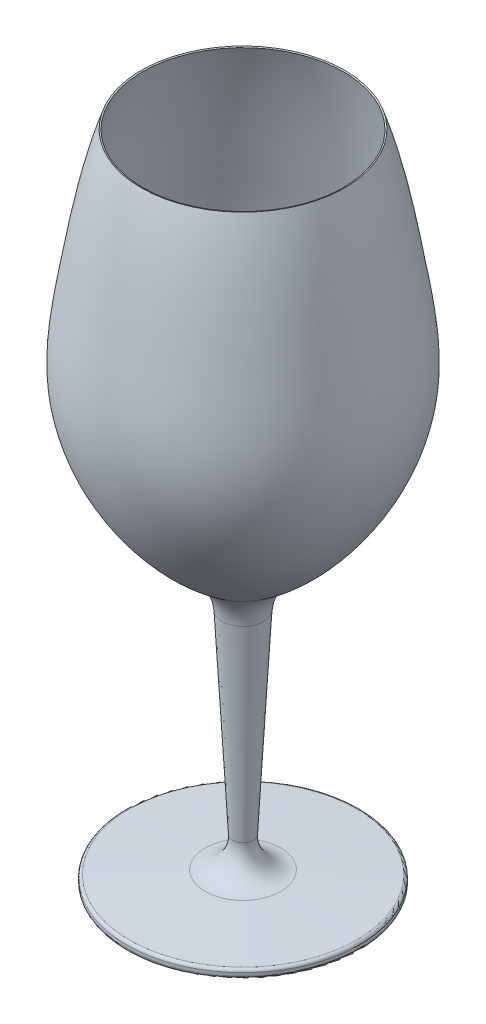
ISO-10303-21;
HEADER;
FILE_DESCRIPTION(('STEP AP214'),'2;1');
FILE_NAME('part.step','',(''),(''),'','','');
FILE_SCHEMA(('AUTOMOTIVE_DESIGN { 1 0 10303 214 1 1 1 1 }'));
ENDSEC;
DATA;
#1=APPLICATION_CONTEXT('core data for automotive mechanical design processes');
#2=APPLICATION_PROTOCOL_DEFINITION('international standard','automotive_design',2000,#1);
#3=PRODUCT_CONTEXT('',#1,'mechanical');
#4=PRODUCT('Part','Part','',(#3));
#5=PRODUCT_RELATED_PRODUCT_CATEGORY('part','',(#4));
#6=PRODUCT_DEFINITION_FORMATION('','',#4);
#7=PRODUCT_DEFINITION_CONTEXT('part definition',#1,'design');
#8=PRODUCT_DEFINITION('design','',#6,#7);
#9=PRODUCT_DEFINITION_SHAPE('','',#8);
#10=(LENGTH_UNIT() NAMED_UNIT(*) SI_UNIT(.MILLI.,.METRE.));
#11=(NAMED_UNIT(*) PLANE_ANGLE_UNIT() SI_UNIT($,.RADIAN.));
#12=(NAMED_UNIT(*) SI_UNIT($,.STERADIAN.) SOLID_ANGLE_UNIT());
#13=UNCERTAINTY_MEASURE_WITH_UNIT(LENGTH_MEASURE(1.E-05),#10,'distance_accuracy_value','');
#14=(GEOMETRIC_REPRESENTATION_CONTEXT(3) GLOBAL_UNCERTAINTY_ASSIGNED_CONTEXT((#13)) GLOBAL_UNIT_ASSIGNED_CONTEXT((#10,
#11,#12)) REPRESENTATION_CONTEXT('',''));
#15=CARTESIAN_POINT('',(0.,0.,0.));
#16=DIRECTION('',(0.,0.,1.));
#17=DIRECTION('',(1.,0.,0.));
#18=AXIS2_PLACEMENT_3D('',#15,#16,#17);
#19=CARTESIAN_POINT('',(7.5,90.5,0.));
#20=DIRECTION('',(0.,-1.,0.));
#21=DIRECTION('',(0.,0.,-1.));
#22=AXIS2_PLACEMENT_3D('',#19,#20,#21);
#23=PLANE('',#22);
#24=CARTESIAN_POINT('',(0.,90.5,0.));
#25=DIRECTION('',(0.,1.,0.));
#26=DIRECTION('',(0.,0.,1.));
#27=AXIS2_PLACEMENT_3D('',#24,#25,#26);
#28=CIRCLE('',#27,7.36580755563535);
#29=CARTESIAN_POINT('',(0.,90.5,7.36580755563535));
#30=VERTEX_POINT('',#29);
#31=EDGE_CURVE('E85',#30,#30,#28,.T.);
#32=ORIENTED_EDGE('',*,*,#31,.T.);
#33=EDGE_LOOP('',(#32));
#34=FACE_BOUND('',#33,.T.);
#35=ADVANCED_FACE('F37',(#34),#23,.F.);
#36=CARTESIAN_POINT('',(35.,225.,0.));
#37=CARTESIAN_POINT('',(39.9170201792757,210.365056176156,0.));
#38=CARTESIAN_POINT('',(44.1056743266489,185.466353245277,0.));
#39=CARTESIAN_POINT('',(52.4361400505516,135.138835851977,0.));
#40=CARTESIAN_POINT('',(28.2814009491732,101.995192324676,0.));
#41=CARTESIAN_POINT('',(7.49999999999999,90.,0.));
#42=B_SPLINE_CURVE_WITH_KNOTS('',3,(#36,#37,#38,#39,#40,#41),.UNSPECIFIED.,.F.,.F.,(4,1,1,4),
(0.,0.30696974385016,0.507280242844437,1.),.UNSPECIFIED.);
#43=CARTESIAN_POINT('',(0.,231.75,0.));
#44=DIRECTION('',(0.,1.,0.));
#45=AXIS1_PLACEMENT('',#43,#44);
#46=SURFACE_OF_REVOLUTION('',#42,#45);
#47=CARTESIAN_POINT('',(0.,94.0246612386085,0.));
#48=DIRECTION('',(0.,1.,0.));
#49=DIRECTION('',(0.,0.,1.));
#50=AXIS2_PLACEMENT_3D('',#47,#48,#49);
#51=CIRCLE('',#50,13.7404106026119);
#52=CARTESIAN_POINT('',(0.,94.0246612386085,13.7404106026119));
#53=VERTEX_POINT('',#52);
#54=EDGE_CURVE('E65',#53,#53,#51,.T.);
#55=ORIENTED_EDGE('',*,*,#54,.T.);
#56=EDGE_LOOP('',(#55));
#57=FACE_BOUND('',#56,.T.);
#58=CARTESIAN_POINT('',(0.,225.,0.));
#59=DIRECTION('',(0.,1.,0.));
#60=DIRECTION('',(0.,0.,1.));
#61=AXIS2_PLACEMENT_3D('',#58,#59,#60);
#62=CIRCLE('',#61,35.);
#63=CARTESIAN_POINT('',(0.,225.,35.));
#64=VERTEX_POINT('',#63);
#65=EDGE_CURVE('E77',#64,#64,#62,.T.);
#66=ORIENTED_EDGE('',*,*,#65,.F.);
#67=EDGE_LOOP('',(#66));
#68=FACE_BOUND('',#67,.T.);
#69=ADVANCED_FACE('F110',(#57,#68),#46,.F.);
#70=CARTESIAN_POINT('',(0.,224.840758404647,0.));
#71=DIRECTION('',(0.,1.,0.));
#72=DIRECTION('',(0.,0.,1.));
#73=AXIS2_PLACEMENT_3D('',#70,#71,#72);
#74=CONICAL_SURFACE('',#73,34.5260357457473,1.24666740101103);
#75=ORIENTED_EDGE('',*,*,#65,.T.);
#76=EDGE_LOOP('',(#75));
#77=FACE_BOUND('',#76,.T.);
#78=CARTESIAN_POINT('',(0.,224.840758404647,0.));
#79=DIRECTION('',(0.,1.,0.));
#80=DIRECTION('',(0.,0.,1.));
#81=AXIS2_PLACEMENT_3D('',#78,#79,#80);
#82=CIRCLE('',#81,34.5260357457473);
#83=CARTESIAN_POINT('',(0.,224.840758404647,34.5260357457473));
#84=VERTEX_POINT('',#83);
#85=EDGE_CURVE('E81',#84,#84,#82,.T.);
#86=ORIENTED_EDGE('',*,*,#85,.F.);
#87=EDGE_LOOP('',(#86));
#88=FACE_BOUND('',#87,.T.);
#89=ADVANCED_FACE('F105',(#77,#88),#74,.F.);
#90=CARTESIAN_POINT('',(34.5260357457473,224.840758404647,0.));
#91=CARTESIAN_POINT('',(38.5134237229265,212.972757680174,0.));
#92=CARTESIAN_POINT('',(40.9330721074188,200.804932363677,0.));
#93=CARTESIAN_POINT('',(43.6025770812448,185.350494263988,0.));
#94=CARTESIAN_POINT('',(44.1195015259819,182.246673106994,0.));
#95=CARTESIAN_POINT('',(45.1551011310871,176.021305771008,0.));
#96=CARTESIAN_POINT('',(45.6664132655204,172.903480540182,0.));
#97=CARTESIAN_POINT('',(46.9540801874857,163.5571058913,0.));
#98=CARTESIAN_POINT('',(47.483447686818,157.336251857612,0.));
#99=CARTESIAN_POINT('',(46.887857201014,148.109063780249,0.));
#100=CARTESIAN_POINT('',(46.4484540362197,145.046089868041,0.));
#101=CARTESIAN_POINT('',(45.1248415608101,138.980779569992,0.));
#102=CARTESIAN_POINT('',(44.2420199226576,135.979713915717,0.));
#103=CARTESIAN_POINT('',(40.9995332141692,127.1369328505,0.));
#104=CARTESIAN_POINT('',(38.0456792538947,121.455648509251,0.));
#105=CARTESIAN_POINT('',(27.3662952808406,105.581699817172,0.));
#106=CARTESIAN_POINT('',(17.8215249659856,96.5608248764769,0.));
#107=CARTESIAN_POINT('',(7.36580755563538,90.5,0.));
#108=B_SPLINE_CURVE_WITH_KNOTS('',3,(#90,#91,#92,#93,#94,#95,#96,#97,#98,#99,#100,#101,#102,
#103,#104,#105,#106,#107),.UNSPECIFIED.,.F.,.F.,(4,2,2,2,2,2,2,2,4),(0.,0.25,0.3125,
0.374999999999999,0.5,0.5625,0.625,0.75,1.),.UNSPECIFIED.);
#109=CARTESIAN_POINT('',(0.,231.75,0.));
#110=DIRECTION('',(0.,1.,0.));
#111=AXIS1_PLACEMENT('',#109,#110);
#112=SURFACE_OF_REVOLUTION('',#108,#111);
#113=ORIENTED_EDGE('',*,*,#31,.F.);
#114=EDGE_LOOP('',(#113));
#115=FACE_BOUND('',#114,.T.);
#116=ORIENTED_EDGE('',*,*,#85,.T.);
#117=EDGE_LOOP('',(#116));
#118=FACE_BOUND('',#117,.T.);
#119=ADVANCED_FACE('F100',(#115,#118),#112,.T.);
#120=CARTESIAN_POINT('',(0.,0.,0.));
#121=DIRECTION('',(0.,1.,0.));
#122=DIRECTION('',(0.,0.,1.));
#123=AXIS2_PLACEMENT_3D('',#120,#121,#122);
#124=PLANE('',#123);
#125=CARTESIAN_POINT('',(0.,0.,0.));
#126=DIRECTION('',(0.,1.,0.));
#127=DIRECTION('',(0.,0.,1.));
#128=AXIS2_PLACEMENT_3D('',#125,#126,#127);
#129=CIRCLE('',#128,39.);
#130=CARTESIAN_POINT('',(0.,0.,39.));
#131=VERTEX_POINT('',#130);
#132=EDGE_CURVE('E45',#131,#131,#129,.F.);
#133=ORIENTED_EDGE('',*,*,#132,.T.);
#134=EDGE_LOOP('',(#133));
#135=FACE_BOUND('',#134,.T.);
#136=ADVANCED_FACE('F104',(#135),#124,.F.);
#137=CARTESIAN_POINT('',(0.,231.75,0.));
#138=DIRECTION('',(0.,1.,0.));
#139=DIRECTION('',(0.,0.,1.));
#140=AXIS2_PLACEMENT_3D('',#137,#138,#139);
#141=CYLINDRICAL_SURFACE('',#140,40.);
#142=CARTESIAN_POINT('',(0.,1.,0.));
#143=DIRECTION('',(0.,1.,0.));
#144=DIRECTION('',(0.,0.,1.));
#145=AXIS2_PLACEMENT_3D('',#142,#143,#144);
#146=CIRCLE('',#145,40.);
#147=CARTESIAN_POINT('',(0.,1.,40.));
#148=VERTEX_POINT('',#147);
#149=EDGE_CURVE('E50',#148,#148,#146,.T.);
#150=ORIENTED_EDGE('',*,*,#149,.T.);
#151=EDGE_LOOP('',(#150));
#152=FACE_BOUND('',#151,.T.);
#153=CARTESIAN_POINT('',(0.,2.05259419926224,0.));
#154=DIRECTION('',(0.,-1.,0.));
#155=DIRECTION('',(0.,0.,-1.));
#156=AXIS2_PLACEMENT_3D('',#153,#154,#155);
#157=CIRCLE('',#156,40.);
#158=CARTESIAN_POINT('',(0.,2.05259419926224,-40.));
#159=VERTEX_POINT('',#158);
#160=EDGE_CURVE('E55',#159,#159,#157,.T.);
#161=ORIENTED_EDGE('',*,*,#160,.T.);
#162=EDGE_LOOP('',(#161));
#163=FACE_BOUND('',#162,.T.);
#164=ADVANCED_FACE('F136',(#152,#163),#141,.T.);
#165=CARTESIAN_POINT('',(0.,3.,0.));
#166=DIRECTION('',(0.,-1.,0.));
#167=DIRECTION('',(0.,0.,-1.));
#168=AXIS2_PLACEMENT_3D('',#165,#166,#167);
#169=CONICAL_SURFACE('',#168,40.,1.51679482641893);
#170=CARTESIAN_POINT('',(0.,3.05113647253973,0.));
#171=DIRECTION('',(0.,1.,0.));
#172=DIRECTION('',(0.,0.,1.));
#173=AXIS2_PLACEMENT_3D('',#170,#171,#172);
#174=CIRCLE('',#173,39.053975258015);
#175=CARTESIAN_POINT('',(0.,3.05113647253973,-39.053975258015));
#176=VERTEX_POINT('',#175);
#177=EDGE_CURVE('E10',#176,#176,#174,.T.);
#178=CARTESIAN_POINT('',(0.,4.46084605201327,0.));
#179=DIRECTION('',(0.,-1.,0.));
#180=DIRECTION('',(0.,0.,-1.));
#181=AXIS2_PLACEMENT_3D('',#178,#179,#180);
#182=CIRCLE('',#181,12.9743480377545);
#183=CARTESIAN_POINT('',(0.,4.46084605201327,-12.9743480377545));
#184=VERTEX_POINT('',#183);
#185=EDGE_CURVE('E69',#184,#184,#182,.T.);
#186=CARTESIAN_POINT('',(0.,3.05113647253973,-39.053975258015));
#187=CARTESIAN_POINT('',(0.,3.06582094732591,-38.7823124744706));
#188=CARTESIAN_POINT('',(0.,3.0805054221121,-38.5106496909263));
#189=CARTESIAN_POINT('',(0.,3.10987437168446,-37.9673241238375));
#190=CARTESIAN_POINT('',(0.,3.12455884647065,-37.6956613402931));
#191=CARTESIAN_POINT('',(0.,3.15392779604301,-37.1523357732043));
#192=CARTESIAN_POINT('',(0.,3.16861227082919,-36.88067298966));
#193=CARTESIAN_POINT('',(0.,3.19798122040156,-36.3373474225712));
#194=CARTESIAN_POINT('',(0.,3.21266569518774,-36.0656846390268));
#195=CARTESIAN_POINT('',(0.,3.24203464476011,-35.5223590719381));
#196=CARTESIAN_POINT('',(0.,3.25671911954629,-35.2506962883937));
#197=CARTESIAN_POINT('',(0.,3.28608806911866,-34.7073707213049));
#198=CARTESIAN_POINT('',(0.,3.30077254390484,-34.4357079377605));
#199=CARTESIAN_POINT('',(0.,3.3301414934772,-33.8923823706718));
#200=CARTESIAN_POINT('',(0.,3.34482596826339,-33.6207195871274));
#201=CARTESIAN_POINT('',(0.,3.37419491783575,-33.0773940200386));
#202=CARTESIAN_POINT('',(0.,3.38887939262193,-32.8057312364943));
#203=CARTESIAN_POINT('',(0.,3.4182483421943,-32.2624056694055));
#204=CARTESIAN_POINT('',(0.,3.43293281698048,-31.9907428858611));
#205=CARTESIAN_POINT('',(0.,3.46230176655285,-31.4474173187724));
#206=CARTESIAN_POINT('',(0.,3.47698624133903,-31.175754535228));
#207=CARTESIAN_POINT('',(0.,3.5063551909114,-30.6324289681392));
#208=CARTESIAN_POINT('',(0.,3.52103966569758,-30.3607661845948));
#209=CARTESIAN_POINT('',(0.,3.55040861526994,-29.8174406175061));
#210=CARTESIAN_POINT('',(0.,3.56509309005613,-29.5457778339617));
#211=CARTESIAN_POINT('',(0.,3.59446203962849,-29.0024522668729));
#212=CARTESIAN_POINT('',(0.,3.60914651441468,-28.7307894833285));
#213=CARTESIAN_POINT('',(0.,3.63851546398704,-28.1874639162398));
#214=CARTESIAN_POINT('',(0.,3.65319993877322,-27.9158011326954));
#215=CARTESIAN_POINT('',(0.,3.68256888834559,-27.3724755656066));
#216=CARTESIAN_POINT('',(0.,3.69725336313177,-27.1008127820623));
#217=CARTESIAN_POINT('',(0.,3.72662231270414,-26.5574872149735));
#218=CARTESIAN_POINT('',(0.,3.74130678749032,-26.2858244314291));
#219=CARTESIAN_POINT('',(0.,3.77067573706269,-25.7424988643404));
#220=CARTESIAN_POINT('',(0.,3.78536021184887,-25.470836080796));
#221=CARTESIAN_POINT('',(0.,3.81472916142123,-24.9275105137072));
#222=CARTESIAN_POINT('',(0.,3.82941363620742,-24.6558477301628));
#223=CARTESIAN_POINT('',(0.,3.85878258577978,-24.1125221630741));
#224=CARTESIAN_POINT('',(0.,3.87346706056596,-23.8408593795297));
#225=CARTESIAN_POINT('',(0.,3.90283601013833,-23.2975338124409));
#226=CARTESIAN_POINT('',(0.,3.91752048492451,-23.0258710288966));
#227=CARTESIAN_POINT('',(0.,3.94688943449688,-22.4825454618078));
#228=CARTESIAN_POINT('',(0.,3.96157390928306,-22.2108826782634));
#229=CARTESIAN_POINT('',(0.,3.99094285885543,-21.6675571111746));
#230=CARTESIAN_POINT('',(0.,4.00562733364161,-21.3958943276303));
#231=CARTESIAN_POINT('',(0.,4.03499628321397,-20.8525687605415));
#232=CARTESIAN_POINT('',(0.,4.04968075800016,-20.5809059769971));
#233=CARTESIAN_POINT('',(0.,4.07904970757252,-20.0375804099084));
#234=CARTESIAN_POINT('',(0.,4.09373418235871,-19.765917626364));
#235=CARTESIAN_POINT('',(0.,4.12310313193107,-19.2225920592752));
#236=CARTESIAN_POINT('',(0.,4.13778760671725,-18.9509292757308));
#237=CARTESIAN_POINT('',(0.,4.16715655628962,-18.4076037086421));
#238=CARTESIAN_POINT('',(0.,4.1818410310758,-18.1359409250977));
#239=CARTESIAN_POINT('',(0.,4.21120998064817,-17.5926153580089));
#240=CARTESIAN_POINT('',(0.,4.22589445543435,-17.3209525744646));
#241=CARTESIAN_POINT('',(0.,4.25526340500672,-16.7776270073758));
#242=CARTESIAN_POINT('',(0.,4.2699478797929,-16.5059642238314));
#243=CARTESIAN_POINT('',(0.,4.29931682936526,-15.9626386567427));
#244=CARTESIAN_POINT('',(0.,4.31400130415145,-15.6909758731983));
#245=CARTESIAN_POINT('',(0.,4.34337025372381,-15.1476503061095));
#246=CARTESIAN_POINT('',(0.,4.35805472850999,-14.8759875225651));
#247=CARTESIAN_POINT('',(0.,4.38742367808236,-14.3326619554764));
#248=CARTESIAN_POINT('',(0.,4.40210815286854,-14.060999171932));
#249=CARTESIAN_POINT('',(0.,4.43147710244091,-13.5176736048432));
#250=CARTESIAN_POINT('',(0.,4.44616157722709,-13.2460108212988));
#251=CARTESIAN_POINT('',(0.,4.46084605201327,-12.9743480377545));
#252=B_SPLINE_CURVE_WITH_KNOTS('',3,(#186,#187,#188,#189,#190,#191,#192,#193,#194,#195,#196,
#197,#198,#199,#200,#201,#202,#203,#204,#205,#206,#207,#208,#209,#210,#211,#212,#213,#214,#215,
#216,#217,#218,#219,#220,#221,#222,#223,#224,#225,#226,#227,#228,#229,#230,#231,#232,#233,#234,
#235,#236,#237,#238,#239,#240,#241,#242,#243,#244,#245,#246,#247,#248,#249,#250,#251),
.UNSPECIFIED.,.F.,.F.,(4,2,2,2,2,2,2,2,2,2,2,2,2,2,2,2,2,2,2,2,2,2,2,2,2,2,2,2,2,2,2,2,4),(0.,
0.816178115282103,1.63235623056421,2.4485343458463,3.2647124611284,4.08089057641051,
4.89706869169261,5.71324680697471,6.52942492225681,7.34560303753891,8.16178115282101,
8.97795926810311,9.79413738338522,10.6103154986673,11.4264936139494,12.2426717292315,
13.0588498445136,13.8750279597957,14.6912060750778,15.5073841903599,16.323562305642,
17.1397404209241,17.9559185362062,18.7720966514883,19.5882747667704,20.4044528820525,
21.2206309973346,22.0368091126167,22.8529872278989,23.669165343181,24.4853434584631,
25.3015215737452,26.1176996890273),.UNSPECIFIED.);
#253=EDGE_CURVE('BSEAM139',#176,#184,#252,.T.);
#254=ORIENTED_EDGE('',*,*,#177,.T.);
#255=ORIENTED_EDGE('',*,*,#185,.T.);
#256=ORIENTED_EDGE('',*,*,#253,.T.);
#257=ORIENTED_EDGE('',*,*,#253,.F.);
#258=EDGE_LOOP('',(#254,#256,#255,#257));
#259=FACE_BOUND('',#258,.T.);
#260=ADVANCED_FACE('F139',(#259),#169,.T.);
#261=CARTESIAN_POINT('',(0.,5.,0.));
#262=DIRECTION('',(0.,1.,0.));
#263=DIRECTION('',(0.,0.,1.));
#264=AXIS2_PLACEMENT_3D('',#261,#262,#263);
#265=CONICAL_SURFACE('',#264,3.00000000000001,0.0528917988657199);
#266=CARTESIAN_POINT('',(0.,81.8552378264217,0.));
#267=DIRECTION('',(0.,-1.,0.));
#268=DIRECTION('',(0.,0.,-1.));
#269=AXIS2_PLACEMENT_3D('',#266,#267,#268);
#270=CIRCLE('',#269,7.06880670845761);
#271=CARTESIAN_POINT('',(0.,81.8552378264217,-7.06880670845761));
#272=VERTEX_POINT('',#271);
#273=EDGE_CURVE('E61',#272,#272,#270,.T.);
#274=ORIENTED_EDGE('',*,*,#273,.T.);
#275=EDGE_LOOP('',(#274));
#276=FACE_BOUND('',#275,.T.);
#277=CARTESIAN_POINT('',(0.,14.9749401961898,0.));
#278=DIRECTION('',(0.,1.,0.));
#279=DIRECTION('',(0.,0.,1.));
#280=AXIS2_PLACEMENT_3D('',#277,#278,#279);
#281=CIRCLE('',#280,3.52808506921006);
#282=CARTESIAN_POINT('',(0.,14.9749401961898,3.52808506921006));
#283=VERTEX_POINT('',#282);
#284=EDGE_CURVE('E73',#283,#283,#281,.T.);
#285=ORIENTED_EDGE('',*,*,#284,.T.);
#286=EDGE_LOOP('',(#285));
#287=FACE_BOUND('',#286,.T.);
#288=ADVANCED_FACE('F122',(#276,#287),#265,.T.);
#289=CARTESIAN_POINT('',(0.,14.4462687847884,0.));
#290=DIRECTION('',(0.,1.,0.));
#291=DIRECTION('',(0.,0.,1.));
#292=AXIS2_PLACEMENT_3D('',#289,#290,#291);
#293=TOROIDAL_SURFACE('',#292,13.5141006179045,10.);
#294=ORIENTED_EDGE('',*,*,#185,.F.);
#295=EDGE_LOOP('',(#294));
#296=FACE_BOUND('',#295,.T.);
#297=ORIENTED_EDGE('',*,*,#284,.F.);
#298=EDGE_LOOP('',(#297));
#299=FACE_BOUND('',#298,.T.);
#300=ADVANCED_FACE('F118',(#296,#299),#293,.F.);
#301=CARTESIAN_POINT('',(0.,81.0093635681793,0.));
#302=DIRECTION('',(0.,1.,0.));
#303=DIRECTION('',(0.,0.,1.));
#304=AXIS2_PLACEMENT_3D('',#301,#302,#303);
#305=TOROIDAL_SURFACE('',#304,23.0464315863687,16.);
#306=ORIENTED_EDGE('',*,*,#273,.F.);
#307=EDGE_LOOP('',(#306));
#308=FACE_BOUND('',#307,.T.);
#309=ORIENTED_EDGE('',*,*,#54,.F.);
#310=EDGE_LOOP('',(#309));
#311=FACE_BOUND('',#310,.T.);
#312=ADVANCED_FACE('F121',(#308,#311),#305,.F.);
#313=CARTESIAN_POINT('',(0.,1.,0.));
#314=DIRECTION('',(0.,1.,0.));
#315=DIRECTION('',(0.,0.,1.));
#316=AXIS2_PLACEMENT_3D('',#313,#314,#315);
#317=TOROIDAL_SURFACE('',#316,39.,1.);
#318=ORIENTED_EDGE('',*,*,#132,.F.);
#319=EDGE_LOOP('',(#318));
#320=FACE_BOUND('',#319,.T.);
#321=ORIENTED_EDGE('',*,*,#149,.F.);
#322=EDGE_LOOP('',(#321));
#323=FACE_BOUND('',#322,.T.);
#324=ADVANCED_FACE('F125',(#320,#323),#317,.T.);
#325=CARTESIAN_POINT('',(0.,2.05259419926224,0.));
#326=DIRECTION('',(0.,-1.,0.));
#327=DIRECTION('',(0.,0.,-1.));
#328=AXIS2_PLACEMENT_3D('',#325,#326,#327);
#329=TOROIDAL_SURFACE('',#328,39.,1.);
#330=ORIENTED_EDGE('',*,*,#160,.F.);
#331=EDGE_LOOP('',(#330));
#332=FACE_BOUND('',#331,.T.);
#333=ORIENTED_EDGE('',*,*,#177,.F.);
#334=EDGE_LOOP('',(#333));
#335=FACE_BOUND('',#334,.T.);
#336=ADVANCED_FACE('F39',(#332,#335),#329,.T.);
#337=CLOSED_SHELL('',(#35,#69,#89,#119,#136,#164,#260,#288,#300,#312,#324,#336));
#338=MANIFOLD_SOLID_BREP('B2',#337);
#339=ADVANCED_BREP_SHAPE_REPRESENTATION('',(#18,#338),#14);
#340=SHAPE_DEFINITION_REPRESENTATION(#9,#339);
ENDSEC;
END-ISO-10303-21;
